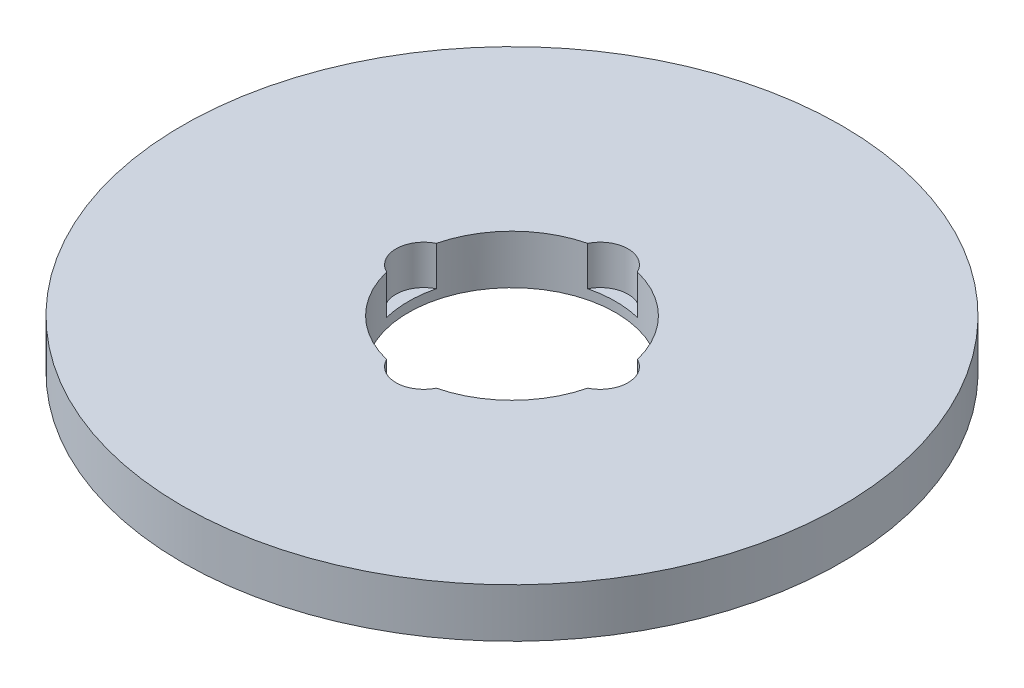
ISO-10303-21;
HEADER;
FILE_DESCRIPTION(('STEP AP214'),'2;1');
FILE_NAME('part.step','',(''),(''),'','','');
FILE_SCHEMA(('AUTOMOTIVE_DESIGN { 1 0 10303 214 1 1 1 1 }'));
ENDSEC;
DATA;
#1=APPLICATION_CONTEXT('core data for automotive mechanical design processes');
#2=APPLICATION_PROTOCOL_DEFINITION('international standard','automotive_design',2000,#1);
#3=PRODUCT_CONTEXT('',#1,'mechanical');
#4=PRODUCT('Part','Part','',(#3));
#5=PRODUCT_RELATED_PRODUCT_CATEGORY('part','',(#4));
#6=PRODUCT_DEFINITION_FORMATION('','',#4);
#7=PRODUCT_DEFINITION_CONTEXT('part definition',#1,'design');
#8=PRODUCT_DEFINITION('design','',#6,#7);
#9=PRODUCT_DEFINITION_SHAPE('','',#8);
#10=(LENGTH_UNIT() NAMED_UNIT(*) SI_UNIT(.MILLI.,.METRE.));
#11=(NAMED_UNIT(*) PLANE_ANGLE_UNIT() SI_UNIT($,.RADIAN.));
#12=(NAMED_UNIT(*) SI_UNIT($,.STERADIAN.) SOLID_ANGLE_UNIT());
#13=UNCERTAINTY_MEASURE_WITH_UNIT(LENGTH_MEASURE(1.E-05),#10,'distance_accuracy_value','');
#14=(GEOMETRIC_REPRESENTATION_CONTEXT(3) GLOBAL_UNCERTAINTY_ASSIGNED_CONTEXT((#13)) GLOBAL_UNIT_ASSIGNED_CONTEXT((#10,
#11,#12)) REPRESENTATION_CONTEXT('',''));
#15=CARTESIAN_POINT('',(0.,0.,0.));
#16=DIRECTION('',(0.,0.,1.));
#17=DIRECTION('',(1.,0.,0.));
#18=AXIS2_PLACEMENT_3D('',#15,#16,#17);
#19=CARTESIAN_POINT('',(0.,13.,0.));
#20=DIRECTION('',(0.,-1.,0.));
#21=DIRECTION('',(0.,0.,-1.));
#22=AXIS2_PLACEMENT_3D('',#19,#20,#21);
#23=CYLINDRICAL_SURFACE('',#22,87.5);
#24=CARTESIAN_POINT('',(0.,13.,0.));
#25=DIRECTION('',(0.,1.,0.));
#26=DIRECTION('',(0.,0.,1.));
#27=AXIS2_PLACEMENT_3D('',#24,#25,#26);
#28=CIRCLE('',#27,87.5);
#29=CARTESIAN_POINT('',(0.,13.,-87.5));
#30=VERTEX_POINT('',#29);
#31=EDGE_CURVE('E148',#30,#30,#28,.T.);
#32=CARTESIAN_POINT('',(0.,0.,0.));
#33=DIRECTION('',(0.,1.,0.));
#34=DIRECTION('',(0.,0.,1.));
#35=AXIS2_PLACEMENT_3D('',#32,#33,#34);
#36=CIRCLE('',#35,87.5);
#37=CARTESIAN_POINT('',(0.,0.,-87.5));
#38=VERTEX_POINT('',#37);
#39=EDGE_CURVE('E139',#38,#38,#36,.T.);
#40=CARTESIAN_POINT('',(0.,13.,-87.5));
#41=CARTESIAN_POINT('',(0.,12.8645833333333,-87.5));
#42=CARTESIAN_POINT('',(0.,12.7291666666667,-87.5));
#43=CARTESIAN_POINT('',(0.,12.4583333333333,-87.5));
#44=CARTESIAN_POINT('',(0.,12.3229166666667,-87.5));
#45=CARTESIAN_POINT('',(0.,12.0520833333333,-87.5));
#46=CARTESIAN_POINT('',(0.,11.9166666666667,-87.5));
#47=CARTESIAN_POINT('',(0.,11.6458333333333,-87.5));
#48=CARTESIAN_POINT('',(0.,11.5104166666667,-87.5));
#49=CARTESIAN_POINT('',(0.,11.2395833333333,-87.5));
#50=CARTESIAN_POINT('',(0.,11.1041666666667,-87.5));
#51=CARTESIAN_POINT('',(0.,10.8333333333333,-87.5));
#52=CARTESIAN_POINT('',(0.,10.6979166666667,-87.5));
#53=CARTESIAN_POINT('',(0.,10.4270833333333,-87.5));
#54=CARTESIAN_POINT('',(0.,10.2916666666667,-87.5));
#55=CARTESIAN_POINT('',(0.,10.0208333333333,-87.5));
#56=CARTESIAN_POINT('',(0.,9.88541666666667,-87.5));
#57=CARTESIAN_POINT('',(0.,9.61458333333333,-87.5));
#58=CARTESIAN_POINT('',(0.,9.47916666666667,-87.5));
#59=CARTESIAN_POINT('',(0.,9.20833333333333,-87.5));
#60=CARTESIAN_POINT('',(0.,9.07291666666666,-87.5));
#61=CARTESIAN_POINT('',(0.,8.80208333333333,-87.5));
#62=CARTESIAN_POINT('',(0.,8.66666666666667,-87.5));
#63=CARTESIAN_POINT('',(0.,8.39583333333333,-87.5));
#64=CARTESIAN_POINT('',(0.,8.26041666666667,-87.5));
#65=CARTESIAN_POINT('',(0.,7.98958333333333,-87.5));
#66=CARTESIAN_POINT('',(0.,7.85416666666667,-87.5));
#67=CARTESIAN_POINT('',(0.,7.58333333333333,-87.5));
#68=CARTESIAN_POINT('',(0.,7.44791666666667,-87.5));
#69=CARTESIAN_POINT('',(0.,7.17708333333333,-87.5));
#70=CARTESIAN_POINT('',(0.,7.04166666666667,-87.5));
#71=CARTESIAN_POINT('',(0.,6.77083333333333,-87.5));
#72=CARTESIAN_POINT('',(0.,6.63541666666667,-87.5));
#73=CARTESIAN_POINT('',(0.,6.36458333333333,-87.5));
#74=CARTESIAN_POINT('',(0.,6.22916666666667,-87.5));
#75=CARTESIAN_POINT('',(0.,5.95833333333333,-87.5));
#76=CARTESIAN_POINT('',(0.,5.82291666666667,-87.5));
#77=CARTESIAN_POINT('',(0.,5.55208333333333,-87.5));
#78=CARTESIAN_POINT('',(0.,5.41666666666667,-87.5));
#79=CARTESIAN_POINT('',(0.,5.14583333333333,-87.5));
#80=CARTESIAN_POINT('',(0.,5.01041666666667,-87.5));
#81=CARTESIAN_POINT('',(0.,4.73958333333333,-87.5));
#82=CARTESIAN_POINT('',(0.,4.60416666666667,-87.5));
#83=CARTESIAN_POINT('',(0.,4.33333333333333,-87.5));
#84=CARTESIAN_POINT('',(0.,4.19791666666667,-87.5));
#85=CARTESIAN_POINT('',(0.,3.92708333333333,-87.5));
#86=CARTESIAN_POINT('',(0.,3.79166666666667,-87.5));
#87=CARTESIAN_POINT('',(0.,3.52083333333333,-87.5));
#88=CARTESIAN_POINT('',(0.,3.38541666666667,-87.5));
#89=CARTESIAN_POINT('',(0.,3.11458333333333,-87.5));
#90=CARTESIAN_POINT('',(0.,2.97916666666667,-87.5));
#91=CARTESIAN_POINT('',(0.,2.70833333333333,-87.5));
#92=CARTESIAN_POINT('',(0.,2.57291666666667,-87.5));
#93=CARTESIAN_POINT('',(0.,2.30208333333333,-87.5));
#94=CARTESIAN_POINT('',(0.,2.16666666666667,-87.5));
#95=CARTESIAN_POINT('',(0.,1.89583333333333,-87.5));
#96=CARTESIAN_POINT('',(0.,1.76041666666667,-87.5));
#97=CARTESIAN_POINT('',(0.,1.48958333333333,-87.5));
#98=CARTESIAN_POINT('',(0.,1.35416666666667,-87.5));
#99=CARTESIAN_POINT('',(0.,1.08333333333333,-87.5));
#100=CARTESIAN_POINT('',(0.,0.947916666666667,-87.5));
#101=CARTESIAN_POINT('',(0.,0.677083333333334,-87.5));
#102=CARTESIAN_POINT('',(0.,0.541666666666667,-87.5));
#103=CARTESIAN_POINT('',(0.,0.270833333333334,-87.5));
#104=CARTESIAN_POINT('',(0.,0.135416666666667,-87.5));
#105=CARTESIAN_POINT('',(0.,0.,-87.5));
#106=B_SPLINE_CURVE_WITH_KNOTS('',3,(#40,#41,#42,#43,#44,#45,#46,#47,#48,#49,#50,#51,#52,#53,
#54,#55,#56,#57,#58,#59,#60,#61,#62,#63,#64,#65,#66,#67,#68,#69,#70,#71,#72,#73,#74,#75,#76,#77,
#78,#79,#80,#81,#82,#83,#84,#85,#86,#87,#88,#89,#90,#91,#92,#93,#94,#95,#96,#97,#98,#99,#100,
#101,#102,#103,#104,#105),.UNSPECIFIED.,.F.,.F.,(4,2,2,2,2,2,2,2,2,2,2,2,2,2,2,2,2,2,2,2,2,2,2,
2,2,2,2,2,2,2,2,2,4),(0.,0.40625,0.812500000000001,1.21875,1.625,2.03125,2.4375,2.84375,3.25,
3.65625,4.0625,4.46875,4.875,5.28125,5.6875,6.09375,6.5,6.90625,7.3125,7.71875,8.125,8.53125,
8.9375,9.34375,9.75,10.15625,10.5625,10.96875,11.375,11.78125,12.1875,12.59375,13.),.UNSPECIFIED.);
#107=EDGE_CURVE('BSEAM39',#30,#38,#106,.T.);
#108=ORIENTED_EDGE('',*,*,#31,.F.);
#109=ORIENTED_EDGE('',*,*,#39,.T.);
#110=ORIENTED_EDGE('',*,*,#107,.T.);
#111=ORIENTED_EDGE('',*,*,#107,.F.);
#112=EDGE_LOOP('',(#108,#110,#109,#111));
#113=FACE_BOUND('',#112,.T.);
#114=ADVANCED_FACE('F39',(#113),#23,.T.);
#115=CARTESIAN_POINT('',(0.,13.,0.));
#116=DIRECTION('',(0.,1.,0.));
#117=DIRECTION('',(0.,0.,1.));
#118=AXIS2_PLACEMENT_3D('',#115,#116,#117);
#119=PLANE('',#118);
#120=CARTESIAN_POINT('',(0.,13.,23.4493610966596));
#121=DIRECTION('',(0.,1.,0.));
#122=DIRECTION('',(1.,0.,0.));
#123=AXIS2_PLACEMENT_3D('',#120,#121,#122);
#124=CIRCLE('',#123,7.34847263719694);
#125=CARTESIAN_POINT('',(-6.59117356125073,13.,26.6984349931877));
#126=VERTEX_POINT('',#125);
#127=CARTESIAN_POINT('',(6.59117356125092,13.,26.6984349931877));
#128=VERTEX_POINT('',#127);
#129=EDGE_CURVE('E175',#126,#128,#124,.T.);
#130=ORIENTED_EDGE('',*,*,#129,.F.);
#131=CARTESIAN_POINT('',(0.,13.,0.));
#132=DIRECTION('',(0.,1.,0.));
#133=DIRECTION('',(0.,0.,1.));
#134=AXIS2_PLACEMENT_3D('',#131,#132,#133);
#135=CIRCLE('',#134,27.5);
#136=CARTESIAN_POINT('',(-26.6984349931877,13.,6.59117356125082));
#137=VERTEX_POINT('',#136);
#138=EDGE_CURVE('E134',#137,#126,#135,.T.);
#139=ORIENTED_EDGE('',*,*,#138,.F.);
#140=CARTESIAN_POINT('',(-23.4493610966596,13.,0.));
#141=DIRECTION('',(0.,1.,0.));
#142=DIRECTION('',(0.,0.,1.));
#143=AXIS2_PLACEMENT_3D('',#140,#141,#142);
#144=CIRCLE('',#143,7.34847263719694);
#145=CARTESIAN_POINT('',(-26.6984349931877,13.,-6.59117356125082));
#146=VERTEX_POINT('',#145);
#147=EDGE_CURVE('E143',#146,#137,#144,.T.);
#148=ORIENTED_EDGE('',*,*,#147,.F.);
#149=CARTESIAN_POINT('',(-6.5911735612511,13.,-26.6984349931876));
#150=VERTEX_POINT('',#149);
#151=EDGE_CURVE('E123',#150,#146,#135,.T.);
#152=ORIENTED_EDGE('',*,*,#151,.F.);
#153=CARTESIAN_POINT('',(-2.45619020030343E-13,13.,-23.4493610966596));
#154=DIRECTION('',(0.,1.,0.));
#155=DIRECTION('',(-1.,0.,0.));
#156=AXIS2_PLACEMENT_3D('',#153,#154,#155);
#157=CIRCLE('',#156,7.34847263719694);
#158=CARTESIAN_POINT('',(6.59117356125054,13.,-26.6984349931877));
#159=VERTEX_POINT('',#158);
#160=EDGE_CURVE('E106',#159,#150,#157,.T.);
#161=ORIENTED_EDGE('',*,*,#160,.F.);
#162=CARTESIAN_POINT('',(26.6984349931877,13.,-6.59117356125082));
#163=VERTEX_POINT('',#162);
#164=EDGE_CURVE('E125',#163,#159,#135,.T.);
#165=ORIENTED_EDGE('',*,*,#164,.F.);
#166=CARTESIAN_POINT('',(23.4493610966596,13.,0.));
#167=DIRECTION('',(0.,1.,0.));
#168=DIRECTION('',(0.,0.,-1.));
#169=AXIS2_PLACEMENT_3D('',#166,#167,#168);
#170=CIRCLE('',#169,7.34847263719694);
#171=CARTESIAN_POINT('',(26.6984349931877,13.,6.59117356125082));
#172=VERTEX_POINT('',#171);
#173=EDGE_CURVE('E286',#172,#163,#170,.T.);
#174=ORIENTED_EDGE('',*,*,#173,.F.);
#175=EDGE_CURVE('E135',#128,#172,#135,.T.);
#176=ORIENTED_EDGE('',*,*,#175,.F.);
#177=EDGE_LOOP('',(#130,#139,#148,#152,#161,#165,#174,#176));
#178=FACE_BOUND('',#177,.T.);
#179=ORIENTED_EDGE('',*,*,#31,.T.);
#180=EDGE_LOOP('',(#179));
#181=FACE_BOUND('',#180,.T.);
#182=ADVANCED_FACE('F118',(#178,#181),#119,.T.);
#183=CARTESIAN_POINT('',(0.,0.,0.));
#184=DIRECTION('',(0.,1.,0.));
#185=DIRECTION('',(0.,0.,1.));
#186=AXIS2_PLACEMENT_3D('',#183,#184,#185);
#187=PLANE('',#186);
#188=CARTESIAN_POINT('',(0.,0.,0.));
#189=DIRECTION('',(0.,1.,0.));
#190=DIRECTION('',(0.,0.,1.));
#191=AXIS2_PLACEMENT_3D('',#188,#189,#190);
#192=CIRCLE('',#191,27.5);
#193=CARTESIAN_POINT('',(0.,0.,27.5));
#194=VERTEX_POINT('',#193);
#195=EDGE_CURVE('E136',#194,#194,#192,.T.);
#196=ORIENTED_EDGE('',*,*,#195,.T.);
#197=EDGE_LOOP('',(#196));
#198=FACE_BOUND('',#197,.T.);
#199=ORIENTED_EDGE('',*,*,#39,.F.);
#200=EDGE_LOOP('',(#199));
#201=FACE_BOUND('',#200,.T.);
#202=ADVANCED_FACE('F187',(#198,#201),#187,.F.);
#203=CARTESIAN_POINT('',(0.,13.,0.));
#204=DIRECTION('',(0.,-1.,0.));
#205=DIRECTION('',(0.,0.,-1.));
#206=AXIS2_PLACEMENT_3D('',#203,#204,#205);
#207=CYLINDRICAL_SURFACE('',#206,27.5);
#208=DIRECTION('',(0.,1.,0.));
#209=VECTOR('',#208,1.);
#210=CARTESIAN_POINT('',(-6.59117356125073,7.77745790160972,26.6984349931877));
#211=LINE('',#210,#209);
#212=CARTESIAN_POINT('',(-6.59117356125073,2.55491580321944,26.6984349931877));
#213=VERTEX_POINT('',#212);
#214=EDGE_CURVE('E11',#213,#126,#211,.T.);
#215=ORIENTED_EDGE('',*,*,#214,.F.);
#216=CARTESIAN_POINT('',(0.,2.55491580321944,0.));
#217=DIRECTION('',(0.,1.,0.));
#218=DIRECTION('',(0.,0.,1.));
#219=AXIS2_PLACEMENT_3D('',#216,#217,#218);
#220=CIRCLE('',#219,27.5);
#221=CARTESIAN_POINT('',(6.59117356125092,2.55491580321944,26.6984349931877));
#222=VERTEX_POINT('',#221);
#223=EDGE_CURVE('E170',#213,#222,#220,.T.);
#224=ORIENTED_EDGE('',*,*,#223,.T.);
#225=DIRECTION('',(0.,1.,0.));
#226=VECTOR('',#225,1.);
#227=CARTESIAN_POINT('',(6.59117356125092,7.77745790160972,26.6984349931877));
#228=LINE('',#227,#226);
#229=EDGE_CURVE('E46',#128,#222,#228,.F.);
#230=ORIENTED_EDGE('',*,*,#229,.F.);
#231=ORIENTED_EDGE('',*,*,#175,.T.);
#232=DIRECTION('',(0.,1.,0.));
#233=VECTOR('',#232,1.);
#234=CARTESIAN_POINT('',(26.6984349931877,7.77745790160972,6.59117356125082));
#235=LINE('',#234,#233);
#236=CARTESIAN_POINT('',(26.6984349931877,2.55491580321944,6.59117356125082));
#237=VERTEX_POINT('',#236);
#238=EDGE_CURVE('E164',#237,#172,#235,.T.);
#239=ORIENTED_EDGE('',*,*,#238,.F.);
#240=CARTESIAN_POINT('',(0.,2.55491580321944,0.));
#241=DIRECTION('',(0.,1.,0.));
#242=DIRECTION('',(0.,0.,1.));
#243=AXIS2_PLACEMENT_3D('',#240,#241,#242);
#244=CIRCLE('',#243,27.5);
#245=CARTESIAN_POINT('',(26.6984349931877,2.55491580321944,-6.59117356125082));
#246=VERTEX_POINT('',#245);
#247=EDGE_CURVE('E115',#237,#246,#244,.T.);
#248=ORIENTED_EDGE('',*,*,#247,.T.);
#249=DIRECTION('',(0.,1.,0.));
#250=VECTOR('',#249,1.);
#251=CARTESIAN_POINT('',(26.6984349931877,7.77745790160972,-6.59117356125082));
#252=LINE('',#251,#250);
#253=EDGE_CURVE('E131',#163,#246,#252,.F.);
#254=ORIENTED_EDGE('',*,*,#253,.F.);
#255=ORIENTED_EDGE('',*,*,#164,.T.);
#256=DIRECTION('',(0.,1.,0.));
#257=VECTOR('',#256,1.);
#258=CARTESIAN_POINT('',(6.59117356125054,7.77745790160972,-26.6984349931877));
#259=LINE('',#258,#257);
#260=CARTESIAN_POINT('',(6.59117356125054,2.55491580321944,-26.6984349931877));
#261=VERTEX_POINT('',#260);
#262=EDGE_CURVE('E105',#261,#159,#259,.T.);
#263=ORIENTED_EDGE('',*,*,#262,.F.);
#264=CARTESIAN_POINT('',(0.,2.55491580321944,0.));
#265=DIRECTION('',(0.,1.,0.));
#266=DIRECTION('',(0.,0.,1.));
#267=AXIS2_PLACEMENT_3D('',#264,#265,#266);
#268=CIRCLE('',#267,27.5);
#269=CARTESIAN_POINT('',(-6.5911735612511,2.55491580321944,-26.6984349931876));
#270=VERTEX_POINT('',#269);
#271=EDGE_CURVE('E159',#261,#270,#268,.T.);
#272=ORIENTED_EDGE('',*,*,#271,.T.);
#273=DIRECTION('',(0.,1.,0.));
#274=VECTOR('',#273,1.);
#275=CARTESIAN_POINT('',(-6.5911735612511,7.77745790160972,-26.6984349931876));
#276=LINE('',#275,#274);
#277=EDGE_CURVE('E114',#150,#270,#276,.F.);
#278=ORIENTED_EDGE('',*,*,#277,.F.);
#279=ORIENTED_EDGE('',*,*,#151,.T.);
#280=DIRECTION('',(0.,1.,0.));
#281=VECTOR('',#280,1.);
#282=CARTESIAN_POINT('',(-26.6984349931877,7.77745790160972,-6.59117356125082));
#283=LINE('',#282,#281);
#284=CARTESIAN_POINT('',(-26.6984349931877,2.55491580321944,-6.59117356125082));
#285=VERTEX_POINT('',#284);
#286=EDGE_CURVE('E160',#285,#146,#283,.T.);
#287=ORIENTED_EDGE('',*,*,#286,.F.);
#288=CARTESIAN_POINT('',(0.,2.55491580321944,0.));
#289=DIRECTION('',(0.,1.,0.));
#290=DIRECTION('',(0.,0.,1.));
#291=AXIS2_PLACEMENT_3D('',#288,#289,#290);
#292=CIRCLE('',#291,27.5);
#293=CARTESIAN_POINT('',(-26.6984349931877,2.55491580321944,6.59117356125082));
#294=VERTEX_POINT('',#293);
#295=EDGE_CURVE('E149',#285,#294,#292,.T.);
#296=ORIENTED_EDGE('',*,*,#295,.T.);
#297=DIRECTION('',(0.,1.,0.));
#298=VECTOR('',#297,1.);
#299=CARTESIAN_POINT('',(-26.6984349931877,7.77745790160972,6.59117356125082));
#300=LINE('',#299,#298);
#301=EDGE_CURVE('E152',#137,#294,#300,.F.);
#302=ORIENTED_EDGE('',*,*,#301,.F.);
#303=ORIENTED_EDGE('',*,*,#138,.T.);
#304=EDGE_LOOP('',(#215,#224,#230,#231,#239,#248,#254,#255,#263,#272,#278,#279,#287,#296,#302,#303));
#305=FACE_BOUND('',#304,.T.);
#306=ORIENTED_EDGE('',*,*,#195,.F.);
#307=EDGE_LOOP('',(#306));
#308=FACE_BOUND('',#307,.T.);
#309=ADVANCED_FACE('F126',(#305,#308),#207,.F.);
#310=CARTESIAN_POINT('',(-23.4493610966596,2.55491580321944,0.));
#311=DIRECTION('',(0.,1.,0.));
#312=DIRECTION('',(0.,0.,1.));
#313=AXIS2_PLACEMENT_3D('',#310,#311,#312);
#314=CYLINDRICAL_SURFACE('',#313,7.34847263719694);
#315=ORIENTED_EDGE('',*,*,#286,.T.);
#316=ORIENTED_EDGE('',*,*,#147,.T.);
#317=ORIENTED_EDGE('',*,*,#301,.T.);
#318=CARTESIAN_POINT('',(-23.4493610966596,2.55491580321944,0.));
#319=DIRECTION('',(0.,1.,0.));
#320=DIRECTION('',(0.,0.,1.));
#321=AXIS2_PLACEMENT_3D('',#318,#319,#320);
#322=CIRCLE('',#321,7.34847263719694);
#323=EDGE_CURVE('E144',#285,#294,#322,.T.);
#324=ORIENTED_EDGE('',*,*,#323,.F.);
#325=EDGE_LOOP('',(#315,#316,#317,#324));
#326=FACE_BOUND('',#325,.T.);
#327=ADVANCED_FACE('F200',(#326),#314,.F.);
#328=CARTESIAN_POINT('',(-23.4493610966596,2.55491580321944,0.));
#329=DIRECTION('',(0.,1.,0.));
#330=DIRECTION('',(0.,0.,1.));
#331=AXIS2_PLACEMENT_3D('',#328,#329,#330);
#332=PLANE('',#331);
#333=ORIENTED_EDGE('',*,*,#323,.T.);
#334=ORIENTED_EDGE('',*,*,#295,.F.);
#335=EDGE_LOOP('',(#333,#334));
#336=FACE_BOUND('',#335,.T.);
#337=ADVANCED_FACE('F201',(#336),#332,.T.);
#338=CARTESIAN_POINT('',(-2.45619020030343E-13,2.55491580321944,-23.4493610966596));
#339=DIRECTION('',(0.,1.,0.));
#340=DIRECTION('',(0.,0.,1.));
#341=AXIS2_PLACEMENT_3D('',#338,#339,#340);
#342=CYLINDRICAL_SURFACE('',#341,7.34847263719694);
#343=ORIENTED_EDGE('',*,*,#262,.T.);
#344=ORIENTED_EDGE('',*,*,#160,.T.);
#345=ORIENTED_EDGE('',*,*,#277,.T.);
#346=CARTESIAN_POINT('',(-2.45619020030343E-13,2.55491580321944,-23.4493610966596));
#347=DIRECTION('',(0.,1.,0.));
#348=DIRECTION('',(-1.,0.,0.));
#349=AXIS2_PLACEMENT_3D('',#346,#347,#348);
#350=CIRCLE('',#349,7.34847263719694);
#351=EDGE_CURVE('E107',#261,#270,#350,.T.);
#352=ORIENTED_EDGE('',*,*,#351,.F.);
#353=EDGE_LOOP('',(#343,#344,#345,#352));
#354=FACE_BOUND('',#353,.T.);
#355=ADVANCED_FACE('F102',(#354),#342,.F.);
#356=CARTESIAN_POINT('',(-2.45619020030343E-13,2.55491580321944,-23.4493610966596));
#357=DIRECTION('',(0.,1.,0.));
#358=DIRECTION('',(-1.,0.,0.));
#359=AXIS2_PLACEMENT_3D('',#356,#357,#358);
#360=PLANE('',#359);
#361=ORIENTED_EDGE('',*,*,#351,.T.);
#362=ORIENTED_EDGE('',*,*,#271,.F.);
#363=EDGE_LOOP('',(#361,#362));
#364=FACE_BOUND('',#363,.T.);
#365=ADVANCED_FACE('F209',(#364),#360,.T.);
#366=CARTESIAN_POINT('',(23.4493610966596,2.55491580321944,0.));
#367=DIRECTION('',(0.,1.,0.));
#368=DIRECTION('',(0.,0.,1.));
#369=AXIS2_PLACEMENT_3D('',#366,#367,#368);
#370=CYLINDRICAL_SURFACE('',#369,7.34847263719694);
#371=ORIENTED_EDGE('',*,*,#238,.T.);
#372=ORIENTED_EDGE('',*,*,#173,.T.);
#373=ORIENTED_EDGE('',*,*,#253,.T.);
#374=CARTESIAN_POINT('',(23.4493610966596,2.55491580321944,0.));
#375=DIRECTION('',(0.,1.,0.));
#376=DIRECTION('',(0.,0.,-1.));
#377=AXIS2_PLACEMENT_3D('',#374,#375,#376);
#378=CIRCLE('',#377,7.34847263719694);
#379=EDGE_CURVE('E56',#237,#246,#378,.T.);
#380=ORIENTED_EDGE('',*,*,#379,.F.);
#381=EDGE_LOOP('',(#371,#372,#373,#380));
#382=FACE_BOUND('',#381,.T.);
#383=ADVANCED_FACE('F213',(#382),#370,.F.);
#384=CARTESIAN_POINT('',(23.4493610966596,2.55491580321944,0.));
#385=DIRECTION('',(0.,1.,0.));
#386=DIRECTION('',(0.,0.,-1.));
#387=AXIS2_PLACEMENT_3D('',#384,#385,#386);
#388=PLANE('',#387);
#389=ORIENTED_EDGE('',*,*,#379,.T.);
#390=ORIENTED_EDGE('',*,*,#247,.F.);
#391=EDGE_LOOP('',(#389,#390));
#392=FACE_BOUND('',#391,.T.);
#393=ADVANCED_FACE('F179',(#392),#388,.T.);
#394=CARTESIAN_POINT('',(0.,2.55491580321944,23.4493610966596));
#395=DIRECTION('',(0.,1.,0.));
#396=DIRECTION('',(0.,0.,1.));
#397=AXIS2_PLACEMENT_3D('',#394,#395,#396);
#398=CYLINDRICAL_SURFACE('',#397,7.34847263719694);
#399=ORIENTED_EDGE('',*,*,#214,.T.);
#400=ORIENTED_EDGE('',*,*,#129,.T.);
#401=ORIENTED_EDGE('',*,*,#229,.T.);
#402=CARTESIAN_POINT('',(0.,2.55491580321944,23.4493610966596));
#403=DIRECTION('',(0.,1.,0.));
#404=DIRECTION('',(1.,0.,0.));
#405=AXIS2_PLACEMENT_3D('',#402,#403,#404);
#406=CIRCLE('',#405,7.34847263719694);
#407=EDGE_CURVE('E55',#213,#222,#406,.T.);
#408=ORIENTED_EDGE('',*,*,#407,.F.);
#409=EDGE_LOOP('',(#399,#400,#401,#408));
#410=FACE_BOUND('',#409,.T.);
#411=ADVANCED_FACE('F171',(#410),#398,.F.);
#412=CARTESIAN_POINT('',(0.,2.55491580321944,23.4493610966596));
#413=DIRECTION('',(0.,1.,0.));
#414=DIRECTION('',(1.,0.,0.));
#415=AXIS2_PLACEMENT_3D('',#412,#413,#414);
#416=PLANE('',#415);
#417=ORIENTED_EDGE('',*,*,#407,.T.);
#418=ORIENTED_EDGE('',*,*,#223,.F.);
#419=EDGE_LOOP('',(#417,#418));
#420=FACE_BOUND('',#419,.T.);
#421=ADVANCED_FACE('F173',(#420),#416,.T.);
#422=CLOSED_SHELL('',(#114,#182,#202,#309,#327,#337,#355,#365,#383,#393,#411,#421));
#423=MANIFOLD_SOLID_BREP('B2',#422);
#424=ADVANCED_BREP_SHAPE_REPRESENTATION('',(#18,#423),#14);
#425=SHAPE_DEFINITION_REPRESENTATION(#9,#424);
ENDSEC;
END-ISO-10303-21;
